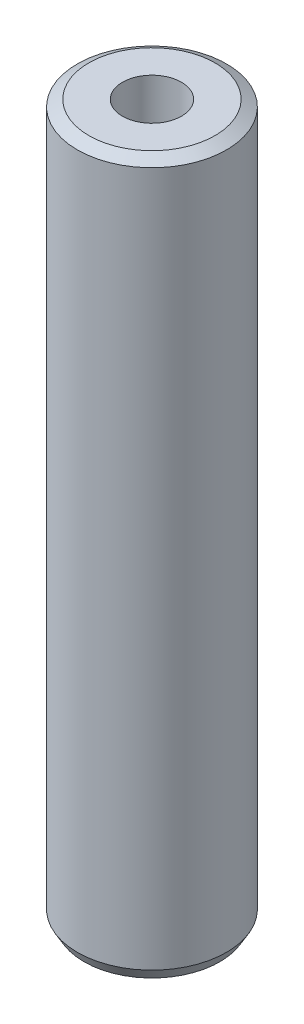
ISO-10303-21;
HEADER;
FILE_DESCRIPTION(('STEP AP214'),'2;1');
FILE_NAME('part.step','',(''),(''),'','','');
FILE_SCHEMA(('AUTOMOTIVE_DESIGN { 1 0 10303 214 1 1 1 1 }'));
ENDSEC;
DATA;
#1=APPLICATION_CONTEXT('core data for automotive mechanical design processes');
#2=APPLICATION_PROTOCOL_DEFINITION('international standard','automotive_design',2000,#1);
#3=PRODUCT_CONTEXT('',#1,'mechanical');
#4=PRODUCT('Part','Part','',(#3));
#5=PRODUCT_RELATED_PRODUCT_CATEGORY('part','',(#4));
#6=PRODUCT_DEFINITION_FORMATION('','',#4);
#7=PRODUCT_DEFINITION_CONTEXT('part definition',#1,'design');
#8=PRODUCT_DEFINITION('design','',#6,#7);
#9=PRODUCT_DEFINITION_SHAPE('','',#8);
#10=(LENGTH_UNIT() NAMED_UNIT(*) SI_UNIT(.MILLI.,.METRE.));
#11=(NAMED_UNIT(*) PLANE_ANGLE_UNIT() SI_UNIT($,.RADIAN.));
#12=(NAMED_UNIT(*) SI_UNIT($,.STERADIAN.) SOLID_ANGLE_UNIT());
#13=UNCERTAINTY_MEASURE_WITH_UNIT(LENGTH_MEASURE(1.E-05),#10,'distance_accuracy_value','');
#14=(GEOMETRIC_REPRESENTATION_CONTEXT(3) GLOBAL_UNCERTAINTY_ASSIGNED_CONTEXT((#13)) GLOBAL_UNIT_ASSIGNED_CONTEXT((#10,
#11,#12)) REPRESENTATION_CONTEXT('',''));
#15=CARTESIAN_POINT('',(0.,0.,0.));
#16=DIRECTION('',(0.,0.,1.));
#17=DIRECTION('',(1.,0.,0.));
#18=AXIS2_PLACEMENT_3D('',#15,#16,#17);
#19=CARTESIAN_POINT('',(0.,478.131743214612,0.));
#20=DIRECTION('',(0.,-1.,0.));
#21=DIRECTION('',(0.,0.,-1.));
#22=AXIS2_PLACEMENT_3D('',#19,#20,#21);
#23=CYLINDRICAL_SURFACE('',#22,50.);
#24=CARTESIAN_POINT('',(0.,473.683809235901,0.));
#25=DIRECTION('',(0.,1.,0.));
#26=DIRECTION('',(0.,0.,1.));
#27=AXIS2_PLACEMENT_3D('',#24,#25,#26);
#28=CIRCLE('',#27,50.);
#29=CARTESIAN_POINT('',(0.,473.683809235901,50.));
#30=VERTEX_POINT('',#29);
#31=EDGE_CURVE('E50',#30,#30,#28,.F.);
#32=ORIENTED_EDGE('',*,*,#31,.T.);
#33=EDGE_LOOP('',(#32));
#34=FACE_BOUND('',#33,.T.);
#35=CARTESIAN_POINT('',(0.,7.70404763984067,0.));
#36=DIRECTION('',(0.,1.,0.));
#37=DIRECTION('',(0.,0.,1.));
#38=AXIS2_PLACEMENT_3D('',#35,#36,#37);
#39=CIRCLE('',#38,50.);
#40=CARTESIAN_POINT('',(0.,7.70404763984067,50.));
#41=VERTEX_POINT('',#40);
#42=EDGE_CURVE('E51',#41,#41,#39,.T.);
#43=ORIENTED_EDGE('',*,*,#42,.T.);
#44=EDGE_LOOP('',(#43));
#45=FACE_BOUND('',#44,.T.);
#46=ADVANCED_FACE('F39',(#34,#45),#23,.T.);
#47=CARTESIAN_POINT('',(0.,478.131743214612,0.));
#48=DIRECTION('',(0.,1.,0.));
#49=DIRECTION('',(0.,0.,1.));
#50=AXIS2_PLACEMENT_3D('',#47,#48,#49);
#51=PLANE('',#50);
#52=CARTESIAN_POINT('',(0.,478.131743214612,0.));
#53=DIRECTION('',(0.,1.,0.));
#54=DIRECTION('',(0.,0.,1.));
#55=AXIS2_PLACEMENT_3D('',#52,#53,#54);
#56=CIRCLE('',#55,42.2959523601592);
#57=CARTESIAN_POINT('',(0.,478.131743214612,42.2959523601592));
#58=VERTEX_POINT('',#57);
#59=EDGE_CURVE('E54',#58,#58,#56,.T.);
#60=ORIENTED_EDGE('',*,*,#59,.T.);
#61=EDGE_LOOP('',(#60));
#62=FACE_BOUND('',#61,.T.);
#63=CARTESIAN_POINT('',(0.,478.131743214612,0.));
#64=DIRECTION('',(0.,1.,0.));
#65=DIRECTION('',(0.,0.,1.));
#66=AXIS2_PLACEMENT_3D('',#63,#64,#65);
#67=CIRCLE('',#66,19.7748497937342);
#68=CARTESIAN_POINT('',(0.,478.131743214612,19.7748497937342));
#69=VERTEX_POINT('',#68);
#70=EDGE_CURVE('E58',#69,#69,#67,.T.);
#71=ORIENTED_EDGE('',*,*,#70,.F.);
#72=EDGE_LOOP('',(#71));
#73=FACE_BOUND('',#72,.T.);
#74=ADVANCED_FACE('F69',(#62,#73),#51,.T.);
#75=CARTESIAN_POINT('',(0.,0.,0.));
#76=DIRECTION('',(0.,1.,0.));
#77=DIRECTION('',(0.,0.,1.));
#78=AXIS2_PLACEMENT_3D('',#75,#76,#77);
#79=PLANE('',#78);
#80=CARTESIAN_POINT('',(0.,0.,0.));
#81=DIRECTION('',(0.,1.,0.));
#82=DIRECTION('',(0.,0.,1.));
#83=AXIS2_PLACEMENT_3D('',#80,#81,#82);
#84=CIRCLE('',#83,45.5520660212883);
#85=CARTESIAN_POINT('',(0.,0.,45.5520660212883));
#86=VERTEX_POINT('',#85);
#87=EDGE_CURVE('E10',#86,#86,#84,.F.);
#88=ORIENTED_EDGE('',*,*,#87,.T.);
#89=EDGE_LOOP('',(#88));
#90=FACE_BOUND('',#89,.T.);
#91=CARTESIAN_POINT('',(0.,0.,0.));
#92=DIRECTION('',(0.,1.,0.));
#93=DIRECTION('',(0.,0.,1.));
#94=AXIS2_PLACEMENT_3D('',#91,#92,#93);
#95=CIRCLE('',#94,19.7748497937342);
#96=CARTESIAN_POINT('',(0.,0.,19.7748497937342));
#97=VERTEX_POINT('',#96);
#98=EDGE_CURVE('E63',#97,#97,#95,.T.);
#99=ORIENTED_EDGE('',*,*,#98,.T.);
#100=EDGE_LOOP('',(#99));
#101=FACE_BOUND('',#100,.T.);
#102=ADVANCED_FACE('F75',(#90,#101),#79,.F.);
#103=CARTESIAN_POINT('',(0.,478.131743214612,0.));
#104=DIRECTION('',(0.,-1.,0.));
#105=DIRECTION('',(0.,0.,-1.));
#106=AXIS2_PLACEMENT_3D('',#103,#104,#105);
#107=CYLINDRICAL_SURFACE('',#106,19.7748497937342);
#108=ORIENTED_EDGE('',*,*,#70,.T.);
#109=EDGE_LOOP('',(#108));
#110=FACE_BOUND('',#109,.T.);
#111=ORIENTED_EDGE('',*,*,#98,.F.);
#112=EDGE_LOOP('',(#111));
#113=FACE_BOUND('',#112,.T.);
#114=ADVANCED_FACE('F70',(#110,#113),#107,.F.);
#115=CARTESIAN_POINT('',(0.,478.131743214612,0.));
#116=DIRECTION('',(0.,-1.,0.));
#117=DIRECTION('',(0.,0.,-1.));
#118=AXIS2_PLACEMENT_3D('',#115,#116,#117);
#119=CONICAL_SURFACE('',#118,42.2959523601592,1.0471975511966);
#120=ORIENTED_EDGE('',*,*,#31,.F.);
#121=EDGE_LOOP('',(#120));
#122=FACE_BOUND('',#121,.T.);
#123=ORIENTED_EDGE('',*,*,#59,.F.);
#124=EDGE_LOOP('',(#123));
#125=FACE_BOUND('',#124,.T.);
#126=ADVANCED_FACE('F81',(#122,#125),#119,.T.);
#127=CARTESIAN_POINT('',(0.,7.70404763984067,0.));
#128=DIRECTION('',(0.,1.,0.));
#129=DIRECTION('',(0.,0.,1.));
#130=AXIS2_PLACEMENT_3D('',#127,#128,#129);
#131=CONICAL_SURFACE('',#130,50.,0.5235987755983);
#132=ORIENTED_EDGE('',*,*,#87,.F.);
#133=EDGE_LOOP('',(#132));
#134=FACE_BOUND('',#133,.T.);
#135=ORIENTED_EDGE('',*,*,#42,.F.);
#136=EDGE_LOOP('',(#135));
#137=FACE_BOUND('',#136,.T.);
#138=ADVANCED_FACE('F45',(#134,#137),#131,.T.);
#139=CLOSED_SHELL('',(#46,#74,#102,#114,#126,#138));
#140=MANIFOLD_SOLID_BREP('B2',#139);
#141=ADVANCED_BREP_SHAPE_REPRESENTATION('',(#18,#140),#14);
#142=SHAPE_DEFINITION_REPRESENTATION(#9,#141);
ENDSEC;
END-ISO-10303-21;
